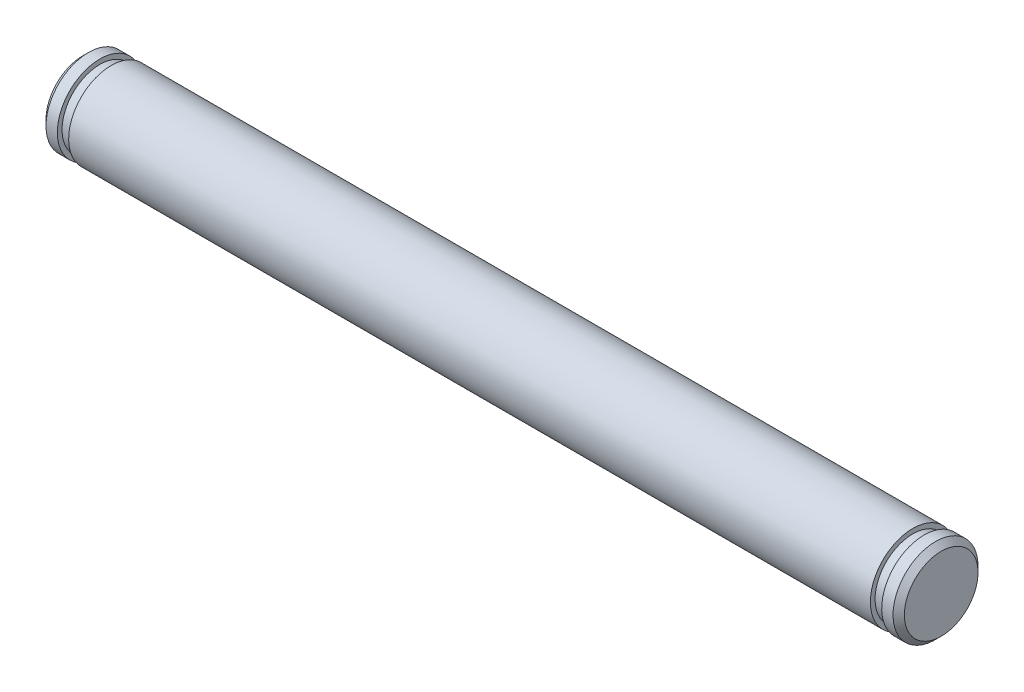
ISO-10303-21;
HEADER;
FILE_DESCRIPTION(('STEP AP214'),'2;1');
FILE_NAME('part.step','',(''),(''),'','','');
FILE_SCHEMA(('AUTOMOTIVE_DESIGN { 1 0 10303 214 1 1 1 1 }'));
ENDSEC;
DATA;
#1=APPLICATION_CONTEXT('core data for automotive mechanical design processes');
#2=APPLICATION_PROTOCOL_DEFINITION('international standard','automotive_design',2000,#1);
#3=PRODUCT_CONTEXT('',#1,'mechanical');
#4=PRODUCT('Part','Part','',(#3));
#5=PRODUCT_RELATED_PRODUCT_CATEGORY('part','',(#4));
#6=PRODUCT_DEFINITION_FORMATION('','',#4);
#7=PRODUCT_DEFINITION_CONTEXT('part definition',#1,'design');
#8=PRODUCT_DEFINITION('design','',#6,#7);
#9=PRODUCT_DEFINITION_SHAPE('','',#8);
#10=(LENGTH_UNIT() NAMED_UNIT(*) SI_UNIT(.MILLI.,.METRE.));
#11=(NAMED_UNIT(*) PLANE_ANGLE_UNIT() SI_UNIT($,.RADIAN.));
#12=(NAMED_UNIT(*) SI_UNIT($,.STERADIAN.) SOLID_ANGLE_UNIT());
#13=UNCERTAINTY_MEASURE_WITH_UNIT(LENGTH_MEASURE(1.E-05),#10,'distance_accuracy_value','');
#14=(GEOMETRIC_REPRESENTATION_CONTEXT(3) GLOBAL_UNCERTAINTY_ASSIGNED_CONTEXT((#13)) GLOBAL_UNIT_ASSIGNED_CONTEXT((#10,
#11,#12)) REPRESENTATION_CONTEXT('',''));
#15=CARTESIAN_POINT('',(0.,0.,0.));
#16=DIRECTION('',(0.,0.,1.));
#17=DIRECTION('',(1.,0.,0.));
#18=AXIS2_PLACEMENT_3D('',#15,#16,#17);
#19=CARTESIAN_POINT('',(-2.,0.,0.));
#20=DIRECTION('',(-1.,0.,0.));
#21=DIRECTION('',(0.,-1.,0.));
#22=AXIS2_PLACEMENT_3D('',#19,#20,#21);
#23=PLANE('',#22);
#24=CARTESIAN_POINT('',(-2.,0.,0.));
#25=DIRECTION('',(-1.,0.,0.));
#26=DIRECTION('',(0.,-1.,0.));
#27=AXIS2_PLACEMENT_3D('',#24,#25,#26);
#28=CIRCLE('',#27,2.6);
#29=CARTESIAN_POINT('',(-2.,-2.6,0.));
#30=VERTEX_POINT('',#29);
#31=EDGE_CURVE('E43',#30,#30,#28,.T.);
#32=ORIENTED_EDGE('',*,*,#31,.T.);
#33=EDGE_LOOP('',(#32));
#34=FACE_BOUND('',#33,.T.);
#35=ADVANCED_FACE('F32',(#34),#23,.T.);
#36=CARTESIAN_POINT('',(-2.,0.,0.));
#37=DIRECTION('',(1.,0.,0.));
#38=DIRECTION('',(0.,1.,0.));
#39=AXIS2_PLACEMENT_3D('',#36,#37,#38);
#40=CYLINDRICAL_SURFACE('',#39,3.);
#41=CARTESIAN_POINT('',(-1.6,0.,0.));
#42=DIRECTION('',(-1.,0.,0.));
#43=DIRECTION('',(0.,-1.,0.));
#44=AXIS2_PLACEMENT_3D('',#41,#42,#43);
#45=CIRCLE('',#44,3.);
#46=CARTESIAN_POINT('',(-1.6,-3.,0.));
#47=VERTEX_POINT('',#46);
#48=EDGE_CURVE('E47',#47,#47,#45,.F.);
#49=ORIENTED_EDGE('',*,*,#48,.T.);
#50=EDGE_LOOP('',(#49));
#51=FACE_BOUND('',#50,.T.);
#52=CARTESIAN_POINT('',(-0.800000000000001,0.,0.));
#53=DIRECTION('',(1.,0.,0.));
#54=DIRECTION('',(0.,1.,0.));
#55=AXIS2_PLACEMENT_3D('',#52,#53,#54);
#56=CIRCLE('',#55,3.);
#57=CARTESIAN_POINT('',(-0.800000000000001,3.,0.));
#58=VERTEX_POINT('',#57);
#59=EDGE_CURVE('E52',#58,#58,#56,.T.);
#60=ORIENTED_EDGE('',*,*,#59,.F.);
#61=EDGE_LOOP('',(#60));
#62=FACE_BOUND('',#61,.T.);
#63=ADVANCED_FACE('F94',(#51,#62),#40,.T.);
#64=CARTESIAN_POINT('',(-0.800000000000001,3.,0.));
#65=DIRECTION('',(1.,0.,0.));
#66=DIRECTION('',(0.,1.,0.));
#67=AXIS2_PLACEMENT_3D('',#64,#65,#66);
#68=PLANE('',#67);
#69=ORIENTED_EDGE('',*,*,#59,.T.);
#70=EDGE_LOOP('',(#69));
#71=FACE_BOUND('',#70,.T.);
#72=CARTESIAN_POINT('',(-0.800000000000001,0.,0.));
#73=DIRECTION('',(1.,0.,0.));
#74=DIRECTION('',(0.,1.,0.));
#75=AXIS2_PLACEMENT_3D('',#72,#73,#74);
#76=CIRCLE('',#75,2.667);
#77=CARTESIAN_POINT('',(-0.800000000000001,2.667,0.));
#78=VERTEX_POINT('',#77);
#79=EDGE_CURVE('E55',#78,#78,#76,.T.);
#80=ORIENTED_EDGE('',*,*,#79,.F.);
#81=EDGE_LOOP('',(#80));
#82=FACE_BOUND('',#81,.T.);
#83=ADVANCED_FACE('F100',(#71,#82),#68,.T.);
#84=CARTESIAN_POINT('',(-2.,0.,0.));
#85=DIRECTION('',(1.,0.,0.));
#86=DIRECTION('',(0.,1.,0.));
#87=AXIS2_PLACEMENT_3D('',#84,#85,#86);
#88=CYLINDRICAL_SURFACE('',#87,2.667);
#89=ORIENTED_EDGE('',*,*,#79,.T.);
#90=EDGE_LOOP('',(#89));
#91=FACE_BOUND('',#90,.T.);
#92=CARTESIAN_POINT('',(0.,0.,0.));
#93=DIRECTION('',(1.,0.,0.));
#94=DIRECTION('',(0.,1.,0.));
#95=AXIS2_PLACEMENT_3D('',#92,#93,#94);
#96=CIRCLE('',#95,2.667);
#97=CARTESIAN_POINT('',(0.,2.667,0.));
#98=VERTEX_POINT('',#97);
#99=EDGE_CURVE('E58',#98,#98,#96,.T.);
#100=ORIENTED_EDGE('',*,*,#99,.F.);
#101=EDGE_LOOP('',(#100));
#102=FACE_BOUND('',#101,.T.);
#103=ADVANCED_FACE('F121',(#91,#102),#88,.T.);
#104=CARTESIAN_POINT('',(0.,3.,0.));
#105=DIRECTION('',(-1.,0.,0.));
#106=DIRECTION('',(0.,-1.,0.));
#107=AXIS2_PLACEMENT_3D('',#104,#105,#106);
#108=PLANE('',#107);
#109=ORIENTED_EDGE('',*,*,#99,.T.);
#110=EDGE_LOOP('',(#109));
#111=FACE_BOUND('',#110,.T.);
#112=CARTESIAN_POINT('',(0.,0.,0.));
#113=DIRECTION('',(1.,0.,0.));
#114=DIRECTION('',(0.,1.,0.));
#115=AXIS2_PLACEMENT_3D('',#112,#113,#114);
#116=CIRCLE('',#115,3.);
#117=CARTESIAN_POINT('',(0.,3.,0.));
#118=VERTEX_POINT('',#117);
#119=EDGE_CURVE('E61',#118,#118,#116,.T.);
#120=ORIENTED_EDGE('',*,*,#119,.F.);
#121=EDGE_LOOP('',(#120));
#122=FACE_BOUND('',#121,.T.);
#123=ADVANCED_FACE('F126',(#111,#122),#108,.T.);
#124=CARTESIAN_POINT('',(-2.,0.,0.));
#125=DIRECTION('',(1.,0.,0.));
#126=DIRECTION('',(0.,1.,0.));
#127=AXIS2_PLACEMENT_3D('',#124,#125,#126);
#128=CYLINDRICAL_SURFACE('',#127,3.);
#129=ORIENTED_EDGE('',*,*,#119,.T.);
#130=EDGE_LOOP('',(#129));
#131=FACE_BOUND('',#130,.T.);
#132=CARTESIAN_POINT('',(56.602,0.,0.));
#133=DIRECTION('',(1.,0.,0.));
#134=DIRECTION('',(0.,1.,0.));
#135=AXIS2_PLACEMENT_3D('',#132,#133,#134);
#136=CIRCLE('',#135,3.);
#137=CARTESIAN_POINT('',(56.602,3.,0.));
#138=VERTEX_POINT('',#137);
#139=EDGE_CURVE('E64',#138,#138,#136,.T.);
#140=ORIENTED_EDGE('',*,*,#139,.F.);
#141=EDGE_LOOP('',(#140));
#142=FACE_BOUND('',#141,.T.);
#143=ADVANCED_FACE('F132',(#131,#142),#128,.T.);
#144=CARTESIAN_POINT('',(56.602,3.,0.));
#145=DIRECTION('',(1.,0.,0.));
#146=DIRECTION('',(0.,1.,0.));
#147=AXIS2_PLACEMENT_3D('',#144,#145,#146);
#148=PLANE('',#147);
#149=ORIENTED_EDGE('',*,*,#139,.T.);
#150=EDGE_LOOP('',(#149));
#151=FACE_BOUND('',#150,.T.);
#152=CARTESIAN_POINT('',(56.602,0.,0.));
#153=DIRECTION('',(1.,0.,0.));
#154=DIRECTION('',(0.,1.,0.));
#155=AXIS2_PLACEMENT_3D('',#152,#153,#154);
#156=CIRCLE('',#155,2.667);
#157=CARTESIAN_POINT('',(56.602,2.667,0.));
#158=VERTEX_POINT('',#157);
#159=EDGE_CURVE('E67',#158,#158,#156,.T.);
#160=ORIENTED_EDGE('',*,*,#159,.F.);
#161=EDGE_LOOP('',(#160));
#162=FACE_BOUND('',#161,.T.);
#163=ADVANCED_FACE('F90',(#151,#162),#148,.T.);
#164=CARTESIAN_POINT('',(-2.,0.,0.));
#165=DIRECTION('',(1.,0.,0.));
#166=DIRECTION('',(0.,1.,0.));
#167=AXIS2_PLACEMENT_3D('',#164,#165,#166);
#168=CYLINDRICAL_SURFACE('',#167,2.667);
#169=ORIENTED_EDGE('',*,*,#159,.T.);
#170=EDGE_LOOP('',(#169));
#171=FACE_BOUND('',#170,.T.);
#172=CARTESIAN_POINT('',(57.402,0.,0.));
#173=DIRECTION('',(1.,0.,0.));
#174=DIRECTION('',(0.,1.,0.));
#175=AXIS2_PLACEMENT_3D('',#172,#173,#174);
#176=CIRCLE('',#175,2.667);
#177=CARTESIAN_POINT('',(57.402,2.667,0.));
#178=VERTEX_POINT('',#177);
#179=EDGE_CURVE('E70',#178,#178,#176,.T.);
#180=ORIENTED_EDGE('',*,*,#179,.F.);
#181=EDGE_LOOP('',(#180));
#182=FACE_BOUND('',#181,.T.);
#183=ADVANCED_FACE('F81',(#171,#182),#168,.T.);
#184=CARTESIAN_POINT('',(57.402,3.,0.));
#185=DIRECTION('',(-1.,0.,0.));
#186=DIRECTION('',(0.,-1.,0.));
#187=AXIS2_PLACEMENT_3D('',#184,#185,#186);
#188=PLANE('',#187);
#189=ORIENTED_EDGE('',*,*,#179,.T.);
#190=EDGE_LOOP('',(#189));
#191=FACE_BOUND('',#190,.T.);
#192=CARTESIAN_POINT('',(57.402,0.,0.));
#193=DIRECTION('',(1.,0.,0.));
#194=DIRECTION('',(0.,1.,0.));
#195=AXIS2_PLACEMENT_3D('',#192,#193,#194);
#196=CIRCLE('',#195,3.);
#197=CARTESIAN_POINT('',(57.402,3.,0.));
#198=VERTEX_POINT('',#197);
#199=EDGE_CURVE('E73',#198,#198,#196,.T.);
#200=ORIENTED_EDGE('',*,*,#199,.F.);
#201=EDGE_LOOP('',(#200));
#202=FACE_BOUND('',#201,.T.);
#203=ADVANCED_FACE('F79',(#191,#202),#188,.T.);
#204=CARTESIAN_POINT('',(-2.,0.,0.));
#205=DIRECTION('',(1.,0.,0.));
#206=DIRECTION('',(0.,1.,0.));
#207=AXIS2_PLACEMENT_3D('',#204,#205,#206);
#208=CYLINDRICAL_SURFACE('',#207,3.);
#209=CARTESIAN_POINT('',(58.202,0.,0.));
#210=DIRECTION('',(1.,0.,0.));
#211=DIRECTION('',(0.,1.,0.));
#212=AXIS2_PLACEMENT_3D('',#209,#210,#211);
#213=CIRCLE('',#212,3.);
#214=CARTESIAN_POINT('',(58.202,3.,0.));
#215=VERTEX_POINT('',#214);
#216=EDGE_CURVE('E10',#215,#215,#213,.F.);
#217=ORIENTED_EDGE('',*,*,#216,.T.);
#218=EDGE_LOOP('',(#217));
#219=FACE_BOUND('',#218,.T.);
#220=ORIENTED_EDGE('',*,*,#199,.T.);
#221=EDGE_LOOP('',(#220));
#222=FACE_BOUND('',#221,.T.);
#223=ADVANCED_FACE('F77',(#219,#222),#208,.T.);
#224=CARTESIAN_POINT('',(58.602,0.,0.));
#225=DIRECTION('',(1.,0.,0.));
#226=DIRECTION('',(0.,1.,0.));
#227=AXIS2_PLACEMENT_3D('',#224,#225,#226);
#228=PLANE('',#227);
#229=CARTESIAN_POINT('',(58.602,0.,0.));
#230=DIRECTION('',(1.,0.,0.));
#231=DIRECTION('',(0.,1.,0.));
#232=AXIS2_PLACEMENT_3D('',#229,#230,#231);
#233=CIRCLE('',#232,2.59999999999998);
#234=CARTESIAN_POINT('',(58.602,2.59999999999998,0.));
#235=VERTEX_POINT('',#234);
#236=EDGE_CURVE('E39',#235,#235,#233,.T.);
#237=ORIENTED_EDGE('',*,*,#236,.T.);
#238=EDGE_LOOP('',(#237));
#239=FACE_BOUND('',#238,.T.);
#240=ADVANCED_FACE('F88',(#239),#228,.T.);
#241=CARTESIAN_POINT('',(-1.6,0.,0.));
#242=DIRECTION('',(1.,0.,0.));
#243=DIRECTION('',(0.,1.,0.));
#244=AXIS2_PLACEMENT_3D('',#241,#242,#243);
#245=CONICAL_SURFACE('',#244,3.,0.785398163397451);
#246=ORIENTED_EDGE('',*,*,#31,.F.);
#247=EDGE_LOOP('',(#246));
#248=FACE_BOUND('',#247,.T.);
#249=ORIENTED_EDGE('',*,*,#48,.F.);
#250=EDGE_LOOP('',(#249));
#251=FACE_BOUND('',#250,.T.);
#252=ADVANCED_FACE('F104',(#248,#251),#245,.T.);
#253=CARTESIAN_POINT('',(58.602,0.,0.));
#254=DIRECTION('',(-1.,0.,0.));
#255=DIRECTION('',(0.,-1.,0.));
#256=AXIS2_PLACEMENT_3D('',#253,#254,#255);
#257=CONICAL_SURFACE('',#256,2.59999999999998,0.785398163397454);
#258=ORIENTED_EDGE('',*,*,#216,.F.);
#259=EDGE_LOOP('',(#258));
#260=FACE_BOUND('',#259,.T.);
#261=ORIENTED_EDGE('',*,*,#236,.F.);
#262=EDGE_LOOP('',(#261));
#263=FACE_BOUND('',#262,.T.);
#264=ADVANCED_FACE('F34',(#260,#263),#257,.T.);
#265=CLOSED_SHELL('',(#35,#63,#83,#103,#123,#143,#163,#183,#203,#223,#240,#252,#264));
#266=MANIFOLD_SOLID_BREP('B2',#265);
#267=ADVANCED_BREP_SHAPE_REPRESENTATION('',(#18,#266),#14);
#268=SHAPE_DEFINITION_REPRESENTATION(#9,#267);
ENDSEC;
END-ISO-10303-21;
